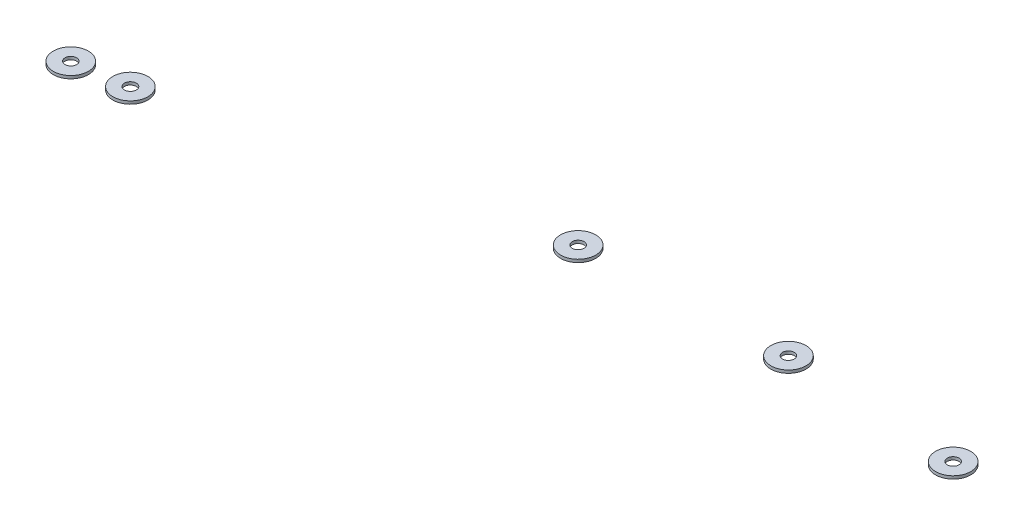
ISO-10303-21;
HEADER;
FILE_DESCRIPTION(('STEP AP214'),'2;1');
FILE_NAME('part.step','',(''),(''),'','','');
FILE_SCHEMA(('AUTOMOTIVE_DESIGN { 1 0 10303 214 1 1 1 1 }'));
ENDSEC;
DATA;
#1=APPLICATION_CONTEXT('core data for automotive mechanical design processes');
#2=APPLICATION_PROTOCOL_DEFINITION('international standard','automotive_design',2000,#1);
#3=PRODUCT_CONTEXT('',#1,'mechanical');
#4=PRODUCT('Part','Part','',(#3));
#5=PRODUCT_RELATED_PRODUCT_CATEGORY('part','',(#4));
#6=PRODUCT_DEFINITION_FORMATION('','',#4);
#7=PRODUCT_DEFINITION_CONTEXT('part definition',#1,'design');
#8=PRODUCT_DEFINITION('design','',#6,#7);
#9=PRODUCT_DEFINITION_SHAPE('','',#8);
#10=(LENGTH_UNIT() NAMED_UNIT(*) SI_UNIT(.MILLI.,.METRE.));
#11=(NAMED_UNIT(*) PLANE_ANGLE_UNIT() SI_UNIT($,.RADIAN.));
#12=(NAMED_UNIT(*) SI_UNIT($,.STERADIAN.) SOLID_ANGLE_UNIT());
#13=UNCERTAINTY_MEASURE_WITH_UNIT(LENGTH_MEASURE(1.E-05),#10,'distance_accuracy_value','');
#14=(GEOMETRIC_REPRESENTATION_CONTEXT(3) GLOBAL_UNCERTAINTY_ASSIGNED_CONTEXT((#13)) GLOBAL_UNIT_ASSIGNED_CONTEXT((#10,
#11,#12)) REPRESENTATION_CONTEXT('',''));
#15=CARTESIAN_POINT('',(0.,0.,0.));
#16=DIRECTION('',(0.,0.,1.));
#17=DIRECTION('',(1.,0.,0.));
#18=AXIS2_PLACEMENT_3D('',#15,#16,#17);
#19=CARTESIAN_POINT('',(-364.051137420954,706.3,296.101801858513));
#20=DIRECTION('',(0.,1.,0.));
#21=DIRECTION('',(0.,0.,1.));
#22=AXIS2_PLACEMENT_3D('',#19,#20,#21);
#23=PLANE('',#22);
#24=CARTESIAN_POINT('',(-364.051137420954,706.3,296.101801858513));
#25=DIRECTION('',(0.,1.,0.));
#26=DIRECTION('',(0.,0.,1.));
#27=AXIS2_PLACEMENT_3D('',#24,#25,#26);
#28=CIRCLE('',#27,5.99999999999999);
#29=CARTESIAN_POINT('',(-364.051137420954,706.3,302.101801858513));
#30=VERTEX_POINT('',#29);
#31=EDGE_CURVE('E11',#30,#30,#28,.T.);
#32=ORIENTED_EDGE('',*,*,#31,.T.);
#33=EDGE_LOOP('',(#32));
#34=FACE_BOUND('',#33,.T.);
#35=CARTESIAN_POINT('',(-364.051137420954,706.3,296.101801858513));
#36=DIRECTION('',(0.,1.,0.));
#37=DIRECTION('',(0.,0.,1.));
#38=AXIS2_PLACEMENT_3D('',#35,#36,#37);
#39=CIRCLE('',#38,2.);
#40=CARTESIAN_POINT('',(-364.051137420954,706.3,298.101801858513));
#41=VERTEX_POINT('',#40);
#42=EDGE_CURVE('E53',#41,#41,#39,.T.);
#43=ORIENTED_EDGE('',*,*,#42,.F.);
#44=EDGE_LOOP('',(#43));
#45=FACE_BOUND('',#44,.T.);
#46=ADVANCED_FACE('F42',(#34,#45),#23,.T.);
#47=CARTESIAN_POINT('',(-364.051137420954,705.3,296.101801858513));
#48=DIRECTION('',(0.,1.,0.));
#49=DIRECTION('',(0.,0.,1.));
#50=AXIS2_PLACEMENT_3D('',#47,#48,#49);
#51=PLANE('',#50);
#52=CARTESIAN_POINT('',(-364.051137420954,705.3,296.101801858513));
#53=DIRECTION('',(0.,1.,0.));
#54=DIRECTION('',(0.,0.,1.));
#55=AXIS2_PLACEMENT_3D('',#52,#53,#54);
#56=CIRCLE('',#55,5.99999999999999);
#57=CARTESIAN_POINT('',(-364.051137420954,705.3,302.101801858513));
#58=VERTEX_POINT('',#57);
#59=EDGE_CURVE('E46',#58,#58,#56,.T.);
#60=ORIENTED_EDGE('',*,*,#59,.F.);
#61=EDGE_LOOP('',(#60));
#62=FACE_BOUND('',#61,.T.);
#63=CARTESIAN_POINT('',(-364.051137420954,705.3,296.101801858513));
#64=DIRECTION('',(0.,1.,0.));
#65=DIRECTION('',(0.,0.,1.));
#66=AXIS2_PLACEMENT_3D('',#63,#64,#65);
#67=CIRCLE('',#66,2.);
#68=CARTESIAN_POINT('',(-364.051137420954,705.3,298.101801858513));
#69=VERTEX_POINT('',#68);
#70=EDGE_CURVE('E55',#69,#69,#67,.T.);
#71=ORIENTED_EDGE('',*,*,#70,.T.);
#72=EDGE_LOOP('',(#71));
#73=FACE_BOUND('',#72,.T.);
#74=ADVANCED_FACE('F65',(#62,#73),#51,.F.);
#75=CARTESIAN_POINT('',(-364.051137420954,706.3,296.101801858513));
#76=DIRECTION('',(0.,-1.,0.));
#77=DIRECTION('',(0.,0.,-1.));
#78=AXIS2_PLACEMENT_3D('',#75,#76,#77);
#79=CYLINDRICAL_SURFACE('',#78,5.99999999999999);
#80=ORIENTED_EDGE('',*,*,#31,.F.);
#81=EDGE_LOOP('',(#80));
#82=FACE_BOUND('',#81,.T.);
#83=ORIENTED_EDGE('',*,*,#59,.T.);
#84=EDGE_LOOP('',(#83));
#85=FACE_BOUND('',#84,.T.);
#86=ADVANCED_FACE('F44',(#82,#85),#79,.T.);
#87=CARTESIAN_POINT('',(-364.051137420954,706.3,296.101801858513));
#88=DIRECTION('',(0.,-1.,0.));
#89=DIRECTION('',(0.,0.,-1.));
#90=AXIS2_PLACEMENT_3D('',#87,#88,#89);
#91=CYLINDRICAL_SURFACE('',#90,2.);
#92=ORIENTED_EDGE('',*,*,#42,.T.);
#93=EDGE_LOOP('',(#92));
#94=FACE_BOUND('',#93,.T.);
#95=ORIENTED_EDGE('',*,*,#70,.F.);
#96=EDGE_LOOP('',(#95));
#97=FACE_BOUND('',#96,.T.);
#98=ADVANCED_FACE('F61',(#94,#97),#91,.F.);
#99=CLOSED_SHELL('',(#46,#74,#86,#98));
#100=MANIFOLD_SOLID_BREP('B2',#99);
#101=CARTESIAN_POINT('',(-346.372819063942,706.3,293.429327819401));
#102=DIRECTION('',(0.,1.,0.));
#103=DIRECTION('',(0.,0.,1.));
#104=AXIS2_PLACEMENT_3D('',#101,#102,#103);
#105=PLANE('',#104);
#106=CARTESIAN_POINT('',(-346.372819063942,706.3,293.429327819401));
#107=DIRECTION('',(0.,1.,0.));
#108=DIRECTION('',(0.,0.,1.));
#109=AXIS2_PLACEMENT_3D('',#106,#107,#108);
#110=CIRCLE('',#109,5.99999999999999);
#111=CARTESIAN_POINT('',(-346.372819063942,706.3,299.429327819401));
#112=VERTEX_POINT('',#111);
#113=EDGE_CURVE('E41',#112,#112,#110,.T.);
#114=ORIENTED_EDGE('',*,*,#113,.T.);
#115=EDGE_LOOP('',(#114));
#116=FACE_BOUND('',#115,.T.);
#117=CARTESIAN_POINT('',(-346.372819063942,706.3,293.429327819401));
#118=DIRECTION('',(0.,1.,0.));
#119=DIRECTION('',(0.,0.,1.));
#120=AXIS2_PLACEMENT_3D('',#117,#118,#119);
#121=CIRCLE('',#120,2.0342194785771);
#122=CARTESIAN_POINT('',(-346.372819063942,706.3,295.463547297979));
#123=VERTEX_POINT('',#122);
#124=EDGE_CURVE('E123',#123,#123,#121,.T.);
#125=ORIENTED_EDGE('',*,*,#124,.F.);
#126=EDGE_LOOP('',(#125));
#127=FACE_BOUND('',#126,.T.);
#128=ADVANCED_FACE('F112',(#116,#127),#105,.T.);
#129=CARTESIAN_POINT('',(-346.372819063942,705.3,293.429327819401));
#130=DIRECTION('',(0.,1.,0.));
#131=DIRECTION('',(0.,0.,1.));
#132=AXIS2_PLACEMENT_3D('',#129,#130,#131);
#133=PLANE('',#132);
#134=CARTESIAN_POINT('',(-346.372819063942,705.3,293.429327819401));
#135=DIRECTION('',(0.,1.,0.));
#136=DIRECTION('',(0.,0.,1.));
#137=AXIS2_PLACEMENT_3D('',#134,#135,#136);
#138=CIRCLE('',#137,5.99999999999999);
#139=CARTESIAN_POINT('',(-346.372819063942,705.3,299.429327819401));
#140=VERTEX_POINT('',#139);
#141=EDGE_CURVE('E116',#140,#140,#138,.T.);
#142=ORIENTED_EDGE('',*,*,#141,.F.);
#143=EDGE_LOOP('',(#142));
#144=FACE_BOUND('',#143,.T.);
#145=CARTESIAN_POINT('',(-346.372819063942,705.3,293.429327819401));
#146=DIRECTION('',(0.,1.,0.));
#147=DIRECTION('',(0.,0.,1.));
#148=AXIS2_PLACEMENT_3D('',#145,#146,#147);
#149=CIRCLE('',#148,2.0342194785771);
#150=CARTESIAN_POINT('',(-346.372819063942,705.3,295.463547297979));
#151=VERTEX_POINT('',#150);
#152=EDGE_CURVE('E125',#151,#151,#149,.T.);
#153=ORIENTED_EDGE('',*,*,#152,.T.);
#154=EDGE_LOOP('',(#153));
#155=FACE_BOUND('',#154,.T.);
#156=ADVANCED_FACE('F135',(#144,#155),#133,.F.);
#157=CARTESIAN_POINT('',(-346.372819063942,706.3,293.429327819401));
#158=DIRECTION('',(0.,-1.,0.));
#159=DIRECTION('',(0.,0.,-1.));
#160=AXIS2_PLACEMENT_3D('',#157,#158,#159);
#161=CYLINDRICAL_SURFACE('',#160,5.99999999999999);
#162=ORIENTED_EDGE('',*,*,#113,.F.);
#163=EDGE_LOOP('',(#162));
#164=FACE_BOUND('',#163,.T.);
#165=ORIENTED_EDGE('',*,*,#141,.T.);
#166=EDGE_LOOP('',(#165));
#167=FACE_BOUND('',#166,.T.);
#168=ADVANCED_FACE('F114',(#164,#167),#161,.T.);
#169=CARTESIAN_POINT('',(-346.372819063942,706.3,293.429327819401));
#170=DIRECTION('',(0.,-1.,0.));
#171=DIRECTION('',(0.,0.,-1.));
#172=AXIS2_PLACEMENT_3D('',#169,#170,#171);
#173=CYLINDRICAL_SURFACE('',#172,2.0342194785771);
#174=ORIENTED_EDGE('',*,*,#124,.T.);
#175=EDGE_LOOP('',(#174));
#176=FACE_BOUND('',#175,.T.);
#177=ORIENTED_EDGE('',*,*,#152,.F.);
#178=EDGE_LOOP('',(#177));
#179=FACE_BOUND('',#178,.T.);
#180=ADVANCED_FACE('F131',(#176,#179),#173,.F.);
#181=CLOSED_SHELL('',(#128,#156,#168,#180));
#182=MANIFOLD_SOLID_BREP('B6',#181);
#183=CARTESIAN_POINT('',(-223.024834580686,706.3,263.802212935845));
#184=DIRECTION('',(0.,1.,0.));
#185=DIRECTION('',(0.,0.,1.));
#186=AXIS2_PLACEMENT_3D('',#183,#184,#185);
#187=PLANE('',#186);
#188=CARTESIAN_POINT('',(-223.024834580686,706.3,263.802212935845));
#189=DIRECTION('',(0.,1.,0.));
#190=DIRECTION('',(0.,0.,1.));
#191=AXIS2_PLACEMENT_3D('',#188,#189,#190);
#192=CIRCLE('',#191,6.00000000000002);
#193=CARTESIAN_POINT('',(-223.024834580686,706.3,269.802212935845));
#194=VERTEX_POINT('',#193);
#195=EDGE_CURVE('E111',#194,#194,#192,.T.);
#196=ORIENTED_EDGE('',*,*,#195,.T.);
#197=EDGE_LOOP('',(#196));
#198=FACE_BOUND('',#197,.T.);
#199=CARTESIAN_POINT('',(-223.024834580686,706.3,263.802212935845));
#200=DIRECTION('',(0.,1.,0.));
#201=DIRECTION('',(0.,0.,1.));
#202=AXIS2_PLACEMENT_3D('',#199,#200,#201);
#203=CIRCLE('',#202,2.);
#204=CARTESIAN_POINT('',(-223.024834580686,706.3,265.802212935845));
#205=VERTEX_POINT('',#204);
#206=EDGE_CURVE('E193',#205,#205,#203,.T.);
#207=ORIENTED_EDGE('',*,*,#206,.F.);
#208=EDGE_LOOP('',(#207));
#209=FACE_BOUND('',#208,.T.);
#210=ADVANCED_FACE('F182',(#198,#209),#187,.T.);
#211=CARTESIAN_POINT('',(-223.024834580686,705.3,263.802212935845));
#212=DIRECTION('',(0.,1.,0.));
#213=DIRECTION('',(0.,0.,1.));
#214=AXIS2_PLACEMENT_3D('',#211,#212,#213);
#215=PLANE('',#214);
#216=CARTESIAN_POINT('',(-223.024834580686,705.3,263.802212935845));
#217=DIRECTION('',(0.,1.,0.));
#218=DIRECTION('',(0.,0.,1.));
#219=AXIS2_PLACEMENT_3D('',#216,#217,#218);
#220=CIRCLE('',#219,6.00000000000002);
#221=CARTESIAN_POINT('',(-223.024834580686,705.3,269.802212935845));
#222=VERTEX_POINT('',#221);
#223=EDGE_CURVE('E186',#222,#222,#220,.T.);
#224=ORIENTED_EDGE('',*,*,#223,.F.);
#225=EDGE_LOOP('',(#224));
#226=FACE_BOUND('',#225,.T.);
#227=CARTESIAN_POINT('',(-223.024834580686,705.3,263.802212935845));
#228=DIRECTION('',(0.,1.,0.));
#229=DIRECTION('',(0.,0.,1.));
#230=AXIS2_PLACEMENT_3D('',#227,#228,#229);
#231=CIRCLE('',#230,2.);
#232=CARTESIAN_POINT('',(-223.024834580686,705.3,265.802212935845));
#233=VERTEX_POINT('',#232);
#234=EDGE_CURVE('E195',#233,#233,#231,.T.);
#235=ORIENTED_EDGE('',*,*,#234,.T.);
#236=EDGE_LOOP('',(#235));
#237=FACE_BOUND('',#236,.T.);
#238=ADVANCED_FACE('F205',(#226,#237),#215,.F.);
#239=CARTESIAN_POINT('',(-223.024834580686,706.3,263.802212935845));
#240=DIRECTION('',(0.,-1.,0.));
#241=DIRECTION('',(0.,0.,-1.));
#242=AXIS2_PLACEMENT_3D('',#239,#240,#241);
#243=CYLINDRICAL_SURFACE('',#242,6.00000000000002);
#244=ORIENTED_EDGE('',*,*,#195,.F.);
#245=EDGE_LOOP('',(#244));
#246=FACE_BOUND('',#245,.T.);
#247=ORIENTED_EDGE('',*,*,#223,.T.);
#248=EDGE_LOOP('',(#247));
#249=FACE_BOUND('',#248,.T.);
#250=ADVANCED_FACE('F184',(#246,#249),#243,.T.);
#251=CARTESIAN_POINT('',(-223.024834580686,706.3,263.802212935845));
#252=DIRECTION('',(0.,-1.,0.));
#253=DIRECTION('',(0.,0.,-1.));
#254=AXIS2_PLACEMENT_3D('',#251,#252,#253);
#255=CYLINDRICAL_SURFACE('',#254,2.);
#256=ORIENTED_EDGE('',*,*,#206,.T.);
#257=EDGE_LOOP('',(#256));
#258=FACE_BOUND('',#257,.T.);
#259=ORIENTED_EDGE('',*,*,#234,.F.);
#260=EDGE_LOOP('',(#259));
#261=FACE_BOUND('',#260,.T.);
#262=ADVANCED_FACE('F201',(#258,#261),#255,.F.);
#263=CLOSED_SHELL('',(#210,#238,#250,#262));
#264=MANIFOLD_SOLID_BREP('B36',#263);
#265=CARTESIAN_POINT('',(-154.344703344319,706.3,260.643821632466));
#266=DIRECTION('',(0.,1.,0.));
#267=DIRECTION('',(0.,0.,1.));
#268=AXIS2_PLACEMENT_3D('',#265,#266,#267);
#269=PLANE('',#268);
#270=CARTESIAN_POINT('',(-154.344703344319,706.3,260.643821632466));
#271=DIRECTION('',(0.,1.,0.));
#272=DIRECTION('',(0.,0.,1.));
#273=AXIS2_PLACEMENT_3D('',#270,#271,#272);
#274=CIRCLE('',#273,6.00000000000002);
#275=CARTESIAN_POINT('',(-154.344703344319,706.3,266.643821632466));
#276=VERTEX_POINT('',#275);
#277=EDGE_CURVE('E181',#276,#276,#274,.T.);
#278=ORIENTED_EDGE('',*,*,#277,.T.);
#279=EDGE_LOOP('',(#278));
#280=FACE_BOUND('',#279,.T.);
#281=CARTESIAN_POINT('',(-154.344703344319,706.3,260.643821632466));
#282=DIRECTION('',(0.,1.,0.));
#283=DIRECTION('',(0.,0.,1.));
#284=AXIS2_PLACEMENT_3D('',#281,#282,#283);
#285=CIRCLE('',#284,2.);
#286=CARTESIAN_POINT('',(-154.344703344319,706.3,262.643821632466));
#287=VERTEX_POINT('',#286);
#288=EDGE_CURVE('E262',#287,#287,#285,.T.);
#289=ORIENTED_EDGE('',*,*,#288,.F.);
#290=EDGE_LOOP('',(#289));
#291=FACE_BOUND('',#290,.T.);
#292=ADVANCED_FACE('F251',(#280,#291),#269,.T.);
#293=CARTESIAN_POINT('',(-154.344703344319,705.3,260.643821632466));
#294=DIRECTION('',(0.,1.,0.));
#295=DIRECTION('',(0.,0.,1.));
#296=AXIS2_PLACEMENT_3D('',#293,#294,#295);
#297=PLANE('',#296);
#298=CARTESIAN_POINT('',(-154.344703344319,705.3,260.643821632466));
#299=DIRECTION('',(0.,1.,0.));
#300=DIRECTION('',(0.,0.,1.));
#301=AXIS2_PLACEMENT_3D('',#298,#299,#300);
#302=CIRCLE('',#301,6.00000000000002);
#303=CARTESIAN_POINT('',(-154.344703344319,705.3,266.643821632466));
#304=VERTEX_POINT('',#303);
#305=EDGE_CURVE('E255',#304,#304,#302,.T.);
#306=ORIENTED_EDGE('',*,*,#305,.F.);
#307=EDGE_LOOP('',(#306));
#308=FACE_BOUND('',#307,.T.);
#309=CARTESIAN_POINT('',(-154.344703344319,705.3,260.643821632466));
#310=DIRECTION('',(0.,1.,0.));
#311=DIRECTION('',(0.,0.,1.));
#312=AXIS2_PLACEMENT_3D('',#309,#310,#311);
#313=CIRCLE('',#312,2.);
#314=CARTESIAN_POINT('',(-154.344703344319,705.3,262.643821632466));
#315=VERTEX_POINT('',#314);
#316=EDGE_CURVE('E264',#315,#315,#313,.T.);
#317=ORIENTED_EDGE('',*,*,#316,.T.);
#318=EDGE_LOOP('',(#317));
#319=FACE_BOUND('',#318,.T.);
#320=ADVANCED_FACE('F274',(#308,#319),#297,.F.);
#321=CARTESIAN_POINT('',(-154.344703344319,706.3,260.643821632466));
#322=DIRECTION('',(0.,-1.,0.));
#323=DIRECTION('',(0.,0.,-1.));
#324=AXIS2_PLACEMENT_3D('',#321,#322,#323);
#325=CYLINDRICAL_SURFACE('',#324,6.00000000000002);
#326=ORIENTED_EDGE('',*,*,#277,.F.);
#327=EDGE_LOOP('',(#326));
#328=FACE_BOUND('',#327,.T.);
#329=ORIENTED_EDGE('',*,*,#305,.T.);
#330=EDGE_LOOP('',(#329));
#331=FACE_BOUND('',#330,.T.);
#332=ADVANCED_FACE('F253',(#328,#331),#325,.T.);
#333=CARTESIAN_POINT('',(-154.344703344319,706.3,260.643821632466));
#334=DIRECTION('',(0.,-1.,0.));
#335=DIRECTION('',(0.,0.,-1.));
#336=AXIS2_PLACEMENT_3D('',#333,#334,#335);
#337=CYLINDRICAL_SURFACE('',#336,2.);
#338=ORIENTED_EDGE('',*,*,#288,.T.);
#339=EDGE_LOOP('',(#338));
#340=FACE_BOUND('',#339,.T.);
#341=ORIENTED_EDGE('',*,*,#316,.F.);
#342=EDGE_LOOP('',(#341));
#343=FACE_BOUND('',#342,.T.);
#344=ADVANCED_FACE('F270',(#340,#343),#337,.F.);
#345=CLOSED_SHELL('',(#292,#320,#332,#344));
#346=MANIFOLD_SOLID_BREP('B106',#345);
#347=CARTESIAN_POINT('',(-94.9095215443751,706.3,263.802212935845));
#348=DIRECTION('',(0.,1.,0.));
#349=DIRECTION('',(0.,0.,1.));
#350=AXIS2_PLACEMENT_3D('',#347,#348,#349);
#351=PLANE('',#350);
#352=CARTESIAN_POINT('',(-94.9095215443751,706.3,263.802212935845));
#353=DIRECTION('',(0.,1.,0.));
#354=DIRECTION('',(0.,0.,1.));
#355=AXIS2_PLACEMENT_3D('',#352,#353,#354);
#356=CIRCLE('',#355,6.);
#357=CARTESIAN_POINT('',(-94.9095215443751,706.3,269.802212935845));
#358=VERTEX_POINT('',#357);
#359=EDGE_CURVE('E250',#358,#358,#356,.T.);
#360=ORIENTED_EDGE('',*,*,#359,.T.);
#361=EDGE_LOOP('',(#360));
#362=FACE_BOUND('',#361,.T.);
#363=CARTESIAN_POINT('',(-94.9095215443751,706.3,263.802212935845));
#364=DIRECTION('',(0.,1.,0.));
#365=DIRECTION('',(0.,0.,1.));
#366=AXIS2_PLACEMENT_3D('',#363,#364,#365);
#367=CIRCLE('',#366,2.);
#368=CARTESIAN_POINT('',(-94.9095215443751,706.3,265.802212935845));
#369=VERTEX_POINT('',#368);
#370=EDGE_CURVE('E324',#369,#369,#367,.T.);
#371=ORIENTED_EDGE('',*,*,#370,.F.);
#372=EDGE_LOOP('',(#371));
#373=FACE_BOUND('',#372,.T.);
#374=ADVANCED_FACE('F313',(#362,#373),#351,.T.);
#375=CARTESIAN_POINT('',(-94.9095215443751,705.3,263.802212935845));
#376=DIRECTION('',(0.,1.,0.));
#377=DIRECTION('',(0.,0.,1.));
#378=AXIS2_PLACEMENT_3D('',#375,#376,#377);
#379=PLANE('',#378);
#380=CARTESIAN_POINT('',(-94.9095215443751,705.3,263.802212935845));
#381=DIRECTION('',(0.,1.,0.));
#382=DIRECTION('',(0.,0.,1.));
#383=AXIS2_PLACEMENT_3D('',#380,#381,#382);
#384=CIRCLE('',#383,6.);
#385=CARTESIAN_POINT('',(-94.9095215443751,705.3,269.802212935845));
#386=VERTEX_POINT('',#385);
#387=EDGE_CURVE('E317',#386,#386,#384,.T.);
#388=ORIENTED_EDGE('',*,*,#387,.F.);
#389=EDGE_LOOP('',(#388));
#390=FACE_BOUND('',#389,.T.);
#391=CARTESIAN_POINT('',(-94.9095215443751,705.3,263.802212935845));
#392=DIRECTION('',(0.,1.,0.));
#393=DIRECTION('',(0.,0.,1.));
#394=AXIS2_PLACEMENT_3D('',#391,#392,#393);
#395=CIRCLE('',#394,2.);
#396=CARTESIAN_POINT('',(-94.9095215443751,705.3,265.802212935845));
#397=VERTEX_POINT('',#396);
#398=EDGE_CURVE('E326',#397,#397,#395,.T.);
#399=ORIENTED_EDGE('',*,*,#398,.T.);
#400=EDGE_LOOP('',(#399));
#401=FACE_BOUND('',#400,.T.);
#402=ADVANCED_FACE('F336',(#390,#401),#379,.F.);
#403=CARTESIAN_POINT('',(-94.9095215443751,706.3,263.802212935845));
#404=DIRECTION('',(0.,-1.,0.));
#405=DIRECTION('',(0.,0.,-1.));
#406=AXIS2_PLACEMENT_3D('',#403,#404,#405);
#407=CYLINDRICAL_SURFACE('',#406,6.);
#408=ORIENTED_EDGE('',*,*,#359,.F.);
#409=EDGE_LOOP('',(#408));
#410=FACE_BOUND('',#409,.T.);
#411=ORIENTED_EDGE('',*,*,#387,.T.);
#412=EDGE_LOOP('',(#411));
#413=FACE_BOUND('',#412,.T.);
#414=ADVANCED_FACE('F315',(#410,#413),#407,.T.);
#415=CARTESIAN_POINT('',(-94.9095215443751,706.3,263.802212935845));
#416=DIRECTION('',(0.,-1.,0.));
#417=DIRECTION('',(0.,0.,-1.));
#418=AXIS2_PLACEMENT_3D('',#415,#416,#417);
#419=CYLINDRICAL_SURFACE('',#418,2.);
#420=ORIENTED_EDGE('',*,*,#370,.T.);
#421=EDGE_LOOP('',(#420));
#422=FACE_BOUND('',#421,.T.);
#423=ORIENTED_EDGE('',*,*,#398,.F.);
#424=EDGE_LOOP('',(#423));
#425=FACE_BOUND('',#424,.T.);
#426=ADVANCED_FACE('F332',(#422,#425),#419,.F.);
#427=CLOSED_SHELL('',(#374,#402,#414,#426));
#428=MANIFOLD_SOLID_BREP('B176',#427);
#429=ADVANCED_BREP_SHAPE_REPRESENTATION('',(#18,#100,#182,#264,#346,#428),#14);
#430=SHAPE_DEFINITION_REPRESENTATION(#9,#429);
ENDSEC;
END-ISO-10303-21;
